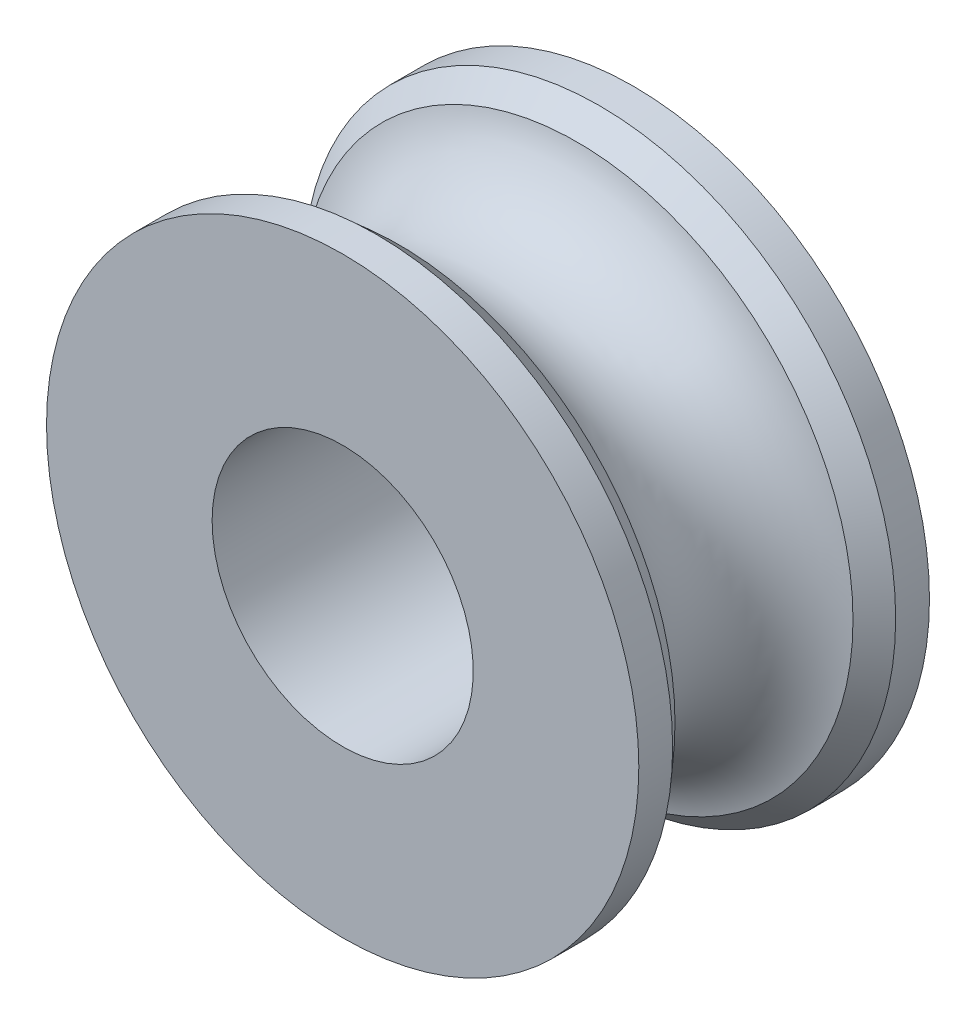
ISO-10303-21;
HEADER;
FILE_DESCRIPTION(('STEP AP214'),'2;1');
FILE_NAME('part.step','',(''),(''),'','','');
FILE_SCHEMA(('AUTOMOTIVE_DESIGN { 1 0 10303 214 1 1 1 1 }'));
ENDSEC;
DATA;
#1=APPLICATION_CONTEXT('core data for automotive mechanical design processes');
#2=APPLICATION_PROTOCOL_DEFINITION('international standard','automotive_design',2000,#1);
#3=PRODUCT_CONTEXT('',#1,'mechanical');
#4=PRODUCT('Part','Part','',(#3));
#5=PRODUCT_RELATED_PRODUCT_CATEGORY('part','',(#4));
#6=PRODUCT_DEFINITION_FORMATION('','',#4);
#7=PRODUCT_DEFINITION_CONTEXT('part definition',#1,'design');
#8=PRODUCT_DEFINITION('design','',#6,#7);
#9=PRODUCT_DEFINITION_SHAPE('','',#8);
#10=(LENGTH_UNIT() NAMED_UNIT(*) SI_UNIT(.MILLI.,.METRE.));
#11=(NAMED_UNIT(*) PLANE_ANGLE_UNIT() SI_UNIT($,.RADIAN.));
#12=(NAMED_UNIT(*) SI_UNIT($,.STERADIAN.) SOLID_ANGLE_UNIT());
#13=UNCERTAINTY_MEASURE_WITH_UNIT(LENGTH_MEASURE(1.E-05),#10,'distance_accuracy_value','');
#14=(GEOMETRIC_REPRESENTATION_CONTEXT(3) GLOBAL_UNCERTAINTY_ASSIGNED_CONTEXT((#13)) GLOBAL_UNIT_ASSIGNED_CONTEXT((#10,
#11,#12)) REPRESENTATION_CONTEXT('',''));
#15=CARTESIAN_POINT('',(0.,0.,0.));
#16=DIRECTION('',(0.,0.,1.));
#17=DIRECTION('',(1.,0.,0.));
#18=AXIS2_PLACEMENT_3D('',#15,#16,#17);
#19=CARTESIAN_POINT('',(0.,0.,14.334));
#20=DIRECTION('',(0.,0.,1.));
#21=DIRECTION('',(1.,0.,0.));
#22=AXIS2_PLACEMENT_3D('',#19,#20,#21);
#23=PLANE('',#22);
#24=CARTESIAN_POINT('',(0.,0.,14.334));
#25=DIRECTION('',(0.,0.,-1.));
#26=DIRECTION('',(1.,0.,0.));
#27=AXIS2_PLACEMENT_3D('',#24,#25,#26);
#28=CIRCLE('',#27,6.4389);
#29=CARTESIAN_POINT('',(-6.4389,0.,14.334));
#30=VERTEX_POINT('',#29);
#31=EDGE_CURVE('E133',#30,#30,#28,.T.);
#32=ORIENTED_EDGE('',*,*,#31,.T.);
#33=EDGE_LOOP('',(#32));
#34=FACE_BOUND('',#33,.T.);
#35=CARTESIAN_POINT('',(0.,0.,14.334));
#36=DIRECTION('',(0.,0.,1.));
#37=DIRECTION('',(1.,0.,0.));
#38=AXIS2_PLACEMENT_3D('',#35,#36,#37);
#39=CIRCLE('',#38,14.605);
#40=CARTESIAN_POINT('',(-14.605,0.,14.334));
#41=VERTEX_POINT('',#40);
#42=EDGE_CURVE('E141',#41,#41,#39,.T.);
#43=ORIENTED_EDGE('',*,*,#42,.T.);
#44=EDGE_LOOP('',(#43));
#45=FACE_BOUND('',#44,.T.);
#46=ADVANCED_FACE('F17',(#34,#45),#23,.T.);
#47=CARTESIAN_POINT('',(0.,0.,7.167));
#48=DIRECTION('',(0.,0.,1.));
#49=DIRECTION('',(1.,0.,0.));
#50=AXIS2_PLACEMENT_3D('',#47,#48,#49);
#51=TOROIDAL_SURFACE('',#50,14.605,4.5);
#52=CARTESIAN_POINT('',(0.,0.,2.77811111111106));
#53=DIRECTION('',(0.,0.,-1.));
#54=DIRECTION('',(-1.,0.,0.));
#55=AXIS2_PLACEMENT_3D('',#52,#53,#54);
#56=CIRCLE('',#55,13.6111920100003);
#57=CARTESIAN_POINT('',(13.6111920100003,0.,2.77811111111106));
#58=VERTEX_POINT('',#57);
#59=CARTESIAN_POINT('',(-13.6111920100003,0.,2.77811111111106));
#60=VERTEX_POINT('',#59);
#61=EDGE_CURVE('E90',#58,#60,#56,.T.);
#62=ORIENTED_EDGE('',*,*,#61,.F.);
#63=CARTESIAN_POINT('',(0.,0.,2.77811111111106));
#64=DIRECTION('',(0.,0.,-1.));
#65=DIRECTION('',(-1.,0.,0.));
#66=AXIS2_PLACEMENT_3D('',#63,#64,#65);
#67=CIRCLE('',#66,13.6111920100003);
#68=EDGE_CURVE('E95',#60,#58,#67,.T.);
#69=ORIENTED_EDGE('',*,*,#68,.F.);
#70=CARTESIAN_POINT('',(-14.605,0.,7.167));
#71=DIRECTION('',(0.,-1.,0.));
#72=DIRECTION('',(-1.,0.,0.));
#73=AXIS2_PLACEMENT_3D('',#70,#71,#72);
#74=CIRCLE('',#73,4.5);
#75=CARTESIAN_POINT('',(-13.6111920100003,0.,11.5558888888889));
#76=VERTEX_POINT('',#75);
#77=EDGE_CURVE('E11',#60,#76,#74,.T.);
#78=ORIENTED_EDGE('',*,*,#77,.T.);
#79=CARTESIAN_POINT('',(0.,0.,11.5558888888889));
#80=DIRECTION('',(0.,0.,1.));
#81=DIRECTION('',(-1.,0.,0.));
#82=AXIS2_PLACEMENT_3D('',#79,#80,#81);
#83=CIRCLE('',#82,13.6111920100003);
#84=CARTESIAN_POINT('',(13.6111920100003,0.,11.5558888888889));
#85=VERTEX_POINT('',#84);
#86=EDGE_CURVE('E109',#85,#76,#83,.T.);
#87=ORIENTED_EDGE('',*,*,#86,.F.);
#88=CARTESIAN_POINT('',(0.,0.,11.5558888888889));
#89=DIRECTION('',(0.,0.,1.));
#90=DIRECTION('',(-1.,0.,0.));
#91=AXIS2_PLACEMENT_3D('',#88,#89,#90);
#92=CIRCLE('',#91,13.6111920100003);
#93=EDGE_CURVE('E92',#76,#85,#92,.T.);
#94=ORIENTED_EDGE('',*,*,#93,.F.);
#95=ORIENTED_EDGE('',*,*,#77,.F.);
#96=EDGE_LOOP('',(#62,#69,#78,#87,#94,#95));
#97=FACE_BOUND('',#96,.T.);
#98=ADVANCED_FACE('F19',(#97),#51,.F.);
#99=CARTESIAN_POINT('',(14.605,0.,0.));
#100=DIRECTION('',(0.,0.,-1.));
#101=DIRECTION('',(0.,-1.,0.));
#102=AXIS2_PLACEMENT_3D('',#99,#100,#101);
#103=PLANE('',#102);
#104=CARTESIAN_POINT('',(0.,0.,0.));
#105=DIRECTION('',(0.,0.,1.));
#106=DIRECTION('',(1.,0.,0.));
#107=AXIS2_PLACEMENT_3D('',#104,#105,#106);
#108=CIRCLE('',#107,6.4389);
#109=CARTESIAN_POINT('',(-6.4389,0.,0.));
#110=VERTEX_POINT('',#109);
#111=EDGE_CURVE('E21',#110,#110,#108,.T.);
#112=ORIENTED_EDGE('',*,*,#111,.T.);
#113=EDGE_LOOP('',(#112));
#114=FACE_BOUND('',#113,.T.);
#115=CARTESIAN_POINT('',(0.,0.,0.));
#116=DIRECTION('',(0.,0.,1.));
#117=DIRECTION('',(1.,0.,0.));
#118=AXIS2_PLACEMENT_3D('',#115,#116,#117);
#119=CIRCLE('',#118,14.605);
#120=CARTESIAN_POINT('',(-14.605,0.,0.));
#121=VERTEX_POINT('',#120);
#122=EDGE_CURVE('E119',#121,#121,#119,.T.);
#123=ORIENTED_EDGE('',*,*,#122,.F.);
#124=EDGE_LOOP('',(#123));
#125=FACE_BOUND('',#124,.T.);
#126=ADVANCED_FACE('F210',(#114,#125),#103,.T.);
#127=CARTESIAN_POINT('',(0.,0.,14.334));
#128=DIRECTION('',(0.,0.,-1.));
#129=DIRECTION('',(1.,0.,0.));
#130=AXIS2_PLACEMENT_3D('',#127,#128,#129);
#131=CYLINDRICAL_SURFACE('',#130,6.4389);
#132=ORIENTED_EDGE('',*,*,#31,.F.);
#133=DIRECTION('',(0.,0.,-1.));
#134=VECTOR('',#133,1.);
#135=CARTESIAN_POINT('',(-6.4389,0.,14.334));
#136=LINE('',#135,#134);
#137=EDGE_CURVE('E44',#30,#110,#136,.T.);
#138=ORIENTED_EDGE('',*,*,#137,.T.);
#139=ORIENTED_EDGE('',*,*,#111,.F.);
#140=ORIENTED_EDGE('',*,*,#137,.F.);
#141=EDGE_LOOP('',(#132,#138,#139,#140));
#142=FACE_BOUND('',#141,.T.);
#143=ADVANCED_FACE('F200',(#142),#131,.F.);
#144=CARTESIAN_POINT('',(0.,0.,13.0005));
#145=DIRECTION('',(0.,0.,1.));
#146=DIRECTION('',(1.,0.,0.));
#147=AXIS2_PLACEMENT_3D('',#144,#145,#146);
#148=CYLINDRICAL_SURFACE('',#147,14.605);
#149=ORIENTED_EDGE('',*,*,#42,.F.);
#150=DIRECTION('',(0.,0.,-1.));
#151=VECTOR('',#150,1.);
#152=CARTESIAN_POINT('',(-14.605,0.,13.0005));
#153=LINE('',#152,#151);
#154=CARTESIAN_POINT('',(-14.605,0.,12.667));
#155=VERTEX_POINT('',#154);
#156=EDGE_CURVE('E136',#41,#155,#153,.T.);
#157=ORIENTED_EDGE('',*,*,#156,.T.);
#158=CARTESIAN_POINT('',(0.,0.,12.667));
#159=DIRECTION('',(0.,0.,-1.));
#160=DIRECTION('',(-1.,0.,0.));
#161=AXIS2_PLACEMENT_3D('',#158,#159,#160);
#162=CIRCLE('',#161,14.605);
#163=CARTESIAN_POINT('',(14.605,0.,12.667));
#164=VERTEX_POINT('',#163);
#165=EDGE_CURVE('E115',#164,#155,#162,.T.);
#166=ORIENTED_EDGE('',*,*,#165,.F.);
#167=CARTESIAN_POINT('',(0.,0.,12.667));
#168=DIRECTION('',(0.,0.,-1.));
#169=DIRECTION('',(-1.,0.,0.));
#170=AXIS2_PLACEMENT_3D('',#167,#168,#169);
#171=CIRCLE('',#170,14.605);
#172=EDGE_CURVE('E113',#155,#164,#171,.T.);
#173=ORIENTED_EDGE('',*,*,#172,.F.);
#174=ORIENTED_EDGE('',*,*,#156,.F.);
#175=EDGE_LOOP('',(#149,#157,#166,#173,#174));
#176=FACE_BOUND('',#175,.T.);
#177=ADVANCED_FACE('F189',(#176),#148,.T.);
#178=CARTESIAN_POINT('',(0.,0.,12.1114444444445));
#179=DIRECTION('',(0.,0.,1.));
#180=DIRECTION('',(-1.,0.,0.));
#181=AXIS2_PLACEMENT_3D('',#178,#179,#180);
#182=CONICAL_SURFACE('',#181,14.1080960050001,0.729727656226888);
#183=ORIENTED_EDGE('',*,*,#165,.T.);
#184=ORIENTED_EDGE('',*,*,#172,.T.);
#185=DIRECTION('',(-0.666666666666608,0.,-0.745355992499982));
#186=VECTOR('',#185,1.);
#187=CARTESIAN_POINT('',(14.1080960050001,0.,12.1114444444445));
#188=LINE('',#187,#186);
#189=EDGE_CURVE('E110',#164,#85,#188,.T.);
#190=ORIENTED_EDGE('',*,*,#189,.T.);
#191=ORIENTED_EDGE('',*,*,#86,.T.);
#192=ORIENTED_EDGE('',*,*,#93,.T.);
#193=ORIENTED_EDGE('',*,*,#189,.F.);
#194=EDGE_LOOP('',(#183,#184,#190,#191,#192,#193));
#195=FACE_BOUND('',#194,.T.);
#196=ADVANCED_FACE('F178',(#195),#182,.T.);
#197=CARTESIAN_POINT('',(0.,0.,1.3335));
#198=DIRECTION('',(0.,0.,1.));
#199=DIRECTION('',(1.,0.,0.));
#200=AXIS2_PLACEMENT_3D('',#197,#198,#199);
#201=CYLINDRICAL_SURFACE('',#200,14.605);
#202=CARTESIAN_POINT('',(0.,0.,1.667));
#203=DIRECTION('',(0.,0.,1.));
#204=DIRECTION('',(-1.,0.,0.));
#205=AXIS2_PLACEMENT_3D('',#202,#203,#204);
#206=CIRCLE('',#205,14.605);
#207=CARTESIAN_POINT('',(14.605,0.,1.667));
#208=VERTEX_POINT('',#207);
#209=CARTESIAN_POINT('',(-14.605,0.,1.667));
#210=VERTEX_POINT('',#209);
#211=EDGE_CURVE('E122',#208,#210,#206,.T.);
#212=ORIENTED_EDGE('',*,*,#211,.F.);
#213=CARTESIAN_POINT('',(0.,0.,1.667));
#214=DIRECTION('',(0.,0.,1.));
#215=DIRECTION('',(-1.,0.,0.));
#216=AXIS2_PLACEMENT_3D('',#213,#214,#215);
#217=CIRCLE('',#216,14.605);
#218=EDGE_CURVE('E125',#210,#208,#217,.T.);
#219=ORIENTED_EDGE('',*,*,#218,.F.);
#220=DIRECTION('',(0.,0.,-1.));
#221=VECTOR('',#220,1.);
#222=CARTESIAN_POINT('',(-14.605,0.,1.3335));
#223=LINE('',#222,#221);
#224=EDGE_CURVE('E129',#210,#121,#223,.T.);
#225=ORIENTED_EDGE('',*,*,#224,.T.);
#226=ORIENTED_EDGE('',*,*,#122,.T.);
#227=ORIENTED_EDGE('',*,*,#224,.F.);
#228=EDGE_LOOP('',(#212,#219,#225,#226,#227));
#229=FACE_BOUND('',#228,.T.);
#230=ADVANCED_FACE('F168',(#229),#201,.T.);
#231=CARTESIAN_POINT('',(0.,0.,2.22255555555553));
#232=DIRECTION('',(0.,0.,-1.));
#233=DIRECTION('',(-1.,0.,0.));
#234=AXIS2_PLACEMENT_3D('',#231,#232,#233);
#235=CONICAL_SURFACE('',#234,14.1080960050001,0.729727656226888);
#236=ORIENTED_EDGE('',*,*,#61,.T.);
#237=ORIENTED_EDGE('',*,*,#68,.T.);
#238=DIRECTION('',(0.666666666666608,0.,-0.745355992499982));
#239=VECTOR('',#238,1.);
#240=CARTESIAN_POINT('',(14.1080960050001,0.,2.22255555555553));
#241=LINE('',#240,#239);
#242=EDGE_CURVE('E99',#58,#208,#241,.T.);
#243=ORIENTED_EDGE('',*,*,#242,.T.);
#244=ORIENTED_EDGE('',*,*,#211,.T.);
#245=ORIENTED_EDGE('',*,*,#218,.T.);
#246=ORIENTED_EDGE('',*,*,#242,.F.);
#247=EDGE_LOOP('',(#236,#237,#243,#244,#245,#246));
#248=FACE_BOUND('',#247,.T.);
#249=ADVANCED_FACE('F101',(#248),#235,.T.);
#250=CLOSED_SHELL('',(#46,#98,#126,#143,#177,#196,#230,#249));
#251=MANIFOLD_SOLID_BREP('B1',#250);
#252=ADVANCED_BREP_SHAPE_REPRESENTATION('',(#18,#251),#14);
#253=SHAPE_DEFINITION_REPRESENTATION(#9,#252);
ENDSEC;
END-ISO-10303-21;
